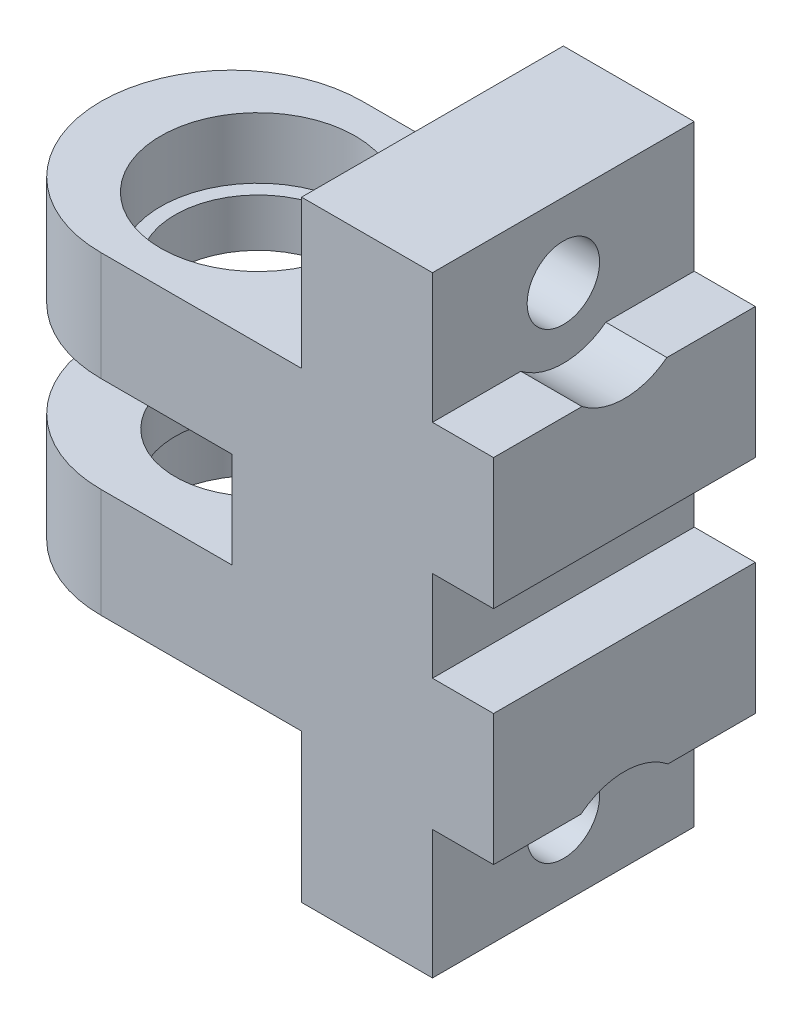
ISO-10303-21;
HEADER;
FILE_DESCRIPTION(('STEP AP214'),'2;1');
FILE_NAME('part.step','',(''),(''),'','','');
FILE_SCHEMA(('AUTOMOTIVE_DESIGN { 1 0 10303 214 1 1 1 1 }'));
ENDSEC;
DATA;
#1=APPLICATION_CONTEXT('core data for automotive mechanical design processes');
#2=APPLICATION_PROTOCOL_DEFINITION('international standard','automotive_design',2000,#1);
#3=PRODUCT_CONTEXT('',#1,'mechanical');
#4=PRODUCT('Part','Part','',(#3));
#5=PRODUCT_RELATED_PRODUCT_CATEGORY('part','',(#4));
#6=PRODUCT_DEFINITION_FORMATION('','',#4);
#7=PRODUCT_DEFINITION_CONTEXT('part definition',#1,'design');
#8=PRODUCT_DEFINITION('design','',#6,#7);
#9=PRODUCT_DEFINITION_SHAPE('','',#8);
#10=(LENGTH_UNIT() NAMED_UNIT(*) SI_UNIT(.MILLI.,.METRE.));
#11=(NAMED_UNIT(*) PLANE_ANGLE_UNIT() SI_UNIT($,.RADIAN.));
#12=(NAMED_UNIT(*) SI_UNIT($,.STERADIAN.) SOLID_ANGLE_UNIT());
#13=UNCERTAINTY_MEASURE_WITH_UNIT(LENGTH_MEASURE(1.E-05),#10,'distance_accuracy_value','');
#14=(GEOMETRIC_REPRESENTATION_CONTEXT(3) GLOBAL_UNCERTAINTY_ASSIGNED_CONTEXT((#13)) GLOBAL_UNIT_ASSIGNED_CONTEXT((#10,
#11,#12)) REPRESENTATION_CONTEXT('',''));
#15=CARTESIAN_POINT('',(0.,0.,0.));
#16=DIRECTION('',(0.,0.,1.));
#17=DIRECTION('',(1.,0.,0.));
#18=AXIS2_PLACEMENT_3D('',#15,#16,#17);
#19=CARTESIAN_POINT('',(0.,36.,0.));
#20=DIRECTION('',(0.,1.,0.));
#21=DIRECTION('',(0.,0.,1.));
#22=AXIS2_PLACEMENT_3D('',#19,#20,#21);
#23=PLANE('',#22);
#24=CARTESIAN_POINT('',(-3.5,36.,0.));
#25=DIRECTION('',(0.,1.,0.));
#26=DIRECTION('',(0.,0.,1.));
#27=AXIS2_PLACEMENT_3D('',#24,#25,#26);
#28=CIRCLE('',#27,11.15);
#29=CARTESIAN_POINT('',(-3.5,36.,11.15));
#30=VERTEX_POINT('',#29);
#31=EDGE_CURVE('E371',#30,#30,#28,.T.);
#32=ORIENTED_EDGE('',*,*,#31,.F.);
#33=EDGE_LOOP('',(#32));
#34=FACE_BOUND('',#33,.T.);
#35=DIRECTION('',(1.,0.,0.));
#36=VECTOR('',#35,1.);
#37=CARTESIAN_POINT('',(21.5,36.,15.));
#38=LINE('',#37,#36);
#39=CARTESIAN_POINT('',(-6.5,36.,15.));
#40=VERTEX_POINT('',#39);
#41=CARTESIAN_POINT('',(16.5,36.,15.));
#42=VERTEX_POINT('',#41);
#43=EDGE_CURVE('E401',#40,#42,#38,.T.);
#44=ORIENTED_EDGE('',*,*,#43,.T.);
#45=DIRECTION('',(0.,0.,1.));
#46=VECTOR('',#45,1.);
#47=CARTESIAN_POINT('',(16.5,36.,-15.));
#48=LINE('',#47,#46);
#49=CARTESIAN_POINT('',(16.5,36.,-15.));
#50=VERTEX_POINT('',#49);
#51=EDGE_CURVE('E238',#50,#42,#48,.T.);
#52=ORIENTED_EDGE('',*,*,#51,.F.);
#53=DIRECTION('',(-1.,0.,0.));
#54=VECTOR('',#53,1.);
#55=CARTESIAN_POINT('',(21.5,36.,-15.));
#56=LINE('',#55,#54);
#57=CARTESIAN_POINT('',(-6.5,36.,-15.));
#58=VERTEX_POINT('',#57);
#59=EDGE_CURVE('E403',#50,#58,#56,.T.);
#60=ORIENTED_EDGE('',*,*,#59,.T.);
#61=CARTESIAN_POINT('',(-6.5,36.,0.));
#62=DIRECTION('',(0.,1.,0.));
#63=DIRECTION('',(0.,0.,1.));
#64=AXIS2_PLACEMENT_3D('',#61,#62,#63);
#65=CIRCLE('',#64,15.);
#66=CARTESIAN_POINT('',(-21.5,36.,0.));
#67=VERTEX_POINT('',#66);
#68=EDGE_CURVE('E45',#58,#67,#65,.T.);
#69=ORIENTED_EDGE('',*,*,#68,.T.);
#70=CARTESIAN_POINT('',(-6.5,36.,0.));
#71=DIRECTION('',(0.,1.,0.));
#72=DIRECTION('',(0.,0.,1.));
#73=AXIS2_PLACEMENT_3D('',#70,#71,#72);
#74=CIRCLE('',#73,15.);
#75=EDGE_CURVE('E11',#67,#40,#74,.T.);
#76=ORIENTED_EDGE('',*,*,#75,.T.);
#77=EDGE_LOOP('',(#44,#52,#60,#69,#76));
#78=FACE_BOUND('',#77,.T.);
#79=ADVANCED_FACE('F36',(#34,#78),#23,.T.);
#80=CARTESIAN_POINT('',(38.5,38.15,15.));
#81=DIRECTION('',(0.,-1.,0.));
#82=DIRECTION('',(0.,0.,-1.));
#83=AXIS2_PLACEMENT_3D('',#80,#81,#82);
#84=PLANE('',#83);
#85=DIRECTION('',(-1.,0.,0.));
#86=VECTOR('',#85,1.);
#87=CARTESIAN_POINT('',(38.5,38.15,4.86595314404075));
#88=LINE('',#87,#86);
#89=CARTESIAN_POINT('',(31.5,38.15,4.86595314404075));
#90=VERTEX_POINT('',#89);
#91=CARTESIAN_POINT('',(38.5,38.15,4.86595314404075));
#92=VERTEX_POINT('',#91);
#93=EDGE_CURVE('E53',#90,#92,#88,.F.);
#94=ORIENTED_EDGE('',*,*,#93,.F.);
#95=DIRECTION('',(0.,0.,1.));
#96=VECTOR('',#95,1.);
#97=CARTESIAN_POINT('',(31.5,38.15,15.));
#98=LINE('',#97,#96);
#99=CARTESIAN_POINT('',(31.5,38.15,15.));
#100=VERTEX_POINT('',#99);
#101=EDGE_CURVE('E311',#90,#100,#98,.T.);
#102=ORIENTED_EDGE('',*,*,#101,.T.);
#103=DIRECTION('',(-1.,0.,0.));
#104=VECTOR('',#103,1.);
#105=CARTESIAN_POINT('',(38.5,38.15,15.));
#106=LINE('',#105,#104);
#107=CARTESIAN_POINT('',(38.5,38.15,15.));
#108=VERTEX_POINT('',#107);
#109=EDGE_CURVE('E335',#108,#100,#106,.T.);
#110=ORIENTED_EDGE('',*,*,#109,.F.);
#111=DIRECTION('',(0.,0.,1.));
#112=VECTOR('',#111,1.);
#113=CARTESIAN_POINT('',(38.5,38.15,15.));
#114=LINE('',#113,#112);
#115=EDGE_CURVE('E315',#92,#108,#114,.T.);
#116=ORIENTED_EDGE('',*,*,#115,.F.);
#117=EDGE_LOOP('',(#94,#102,#110,#116));
#118=FACE_BOUND('',#117,.T.);
#119=ADVANCED_FACE('F525',(#118),#84,.F.);
#120=DIRECTION('',(-1.,0.,0.));
#121=VECTOR('',#120,1.);
#122=CARTESIAN_POINT('',(38.5,38.15,-4.86595314404075));
#123=LINE('',#122,#121);
#124=CARTESIAN_POINT('',(38.5,38.15,-4.86595314404075));
#125=VERTEX_POINT('',#124);
#126=CARTESIAN_POINT('',(31.5,38.15,-4.86595314404075));
#127=VERTEX_POINT('',#126);
#128=EDGE_CURVE('E262',#125,#127,#123,.T.);
#129=ORIENTED_EDGE('',*,*,#128,.F.);
#130=CARTESIAN_POINT('',(38.5,38.15,-15.));
#131=VERTEX_POINT('',#130);
#132=EDGE_CURVE('E317',#131,#125,#114,.T.);
#133=ORIENTED_EDGE('',*,*,#132,.F.);
#134=DIRECTION('',(-1.,0.,0.));
#135=VECTOR('',#134,1.);
#136=CARTESIAN_POINT('',(38.5,38.15,-15.));
#137=LINE('',#136,#135);
#138=CARTESIAN_POINT('',(31.5,38.15,-15.));
#139=VERTEX_POINT('',#138);
#140=EDGE_CURVE('E337',#131,#139,#137,.T.);
#141=ORIENTED_EDGE('',*,*,#140,.T.);
#142=EDGE_CURVE('E325',#139,#127,#98,.T.);
#143=ORIENTED_EDGE('',*,*,#142,.T.);
#144=EDGE_LOOP('',(#129,#133,#141,#143));
#145=FACE_BOUND('',#144,.T.);
#146=ADVANCED_FACE('F469',(#145),#84,.F.);
#147=CARTESIAN_POINT('',(38.5,-2.25,15.));
#148=DIRECTION('',(0.,1.,0.));
#149=DIRECTION('',(0.,0.,1.));
#150=AXIS2_PLACEMENT_3D('',#147,#148,#149);
#151=PLANE('',#150);
#152=DIRECTION('',(-1.,0.,0.));
#153=VECTOR('',#152,1.);
#154=CARTESIAN_POINT('',(38.5,-2.25,-4.99374608885954));
#155=LINE('',#154,#153);
#156=CARTESIAN_POINT('',(31.5,-2.25,-4.99374608885954));
#157=VERTEX_POINT('',#156);
#158=CARTESIAN_POINT('',(38.5,-2.25,-4.99374608885954));
#159=VERTEX_POINT('',#158);
#160=EDGE_CURVE('E61',#157,#159,#155,.F.);
#161=ORIENTED_EDGE('',*,*,#160,.F.);
#162=DIRECTION('',(0.,0.,-1.));
#163=VECTOR('',#162,1.);
#164=CARTESIAN_POINT('',(31.5,-2.25,15.));
#165=LINE('',#164,#163);
#166=CARTESIAN_POINT('',(31.5,-2.25,-15.));
#167=VERTEX_POINT('',#166);
#168=EDGE_CURVE('E297',#157,#167,#165,.T.);
#169=ORIENTED_EDGE('',*,*,#168,.T.);
#170=DIRECTION('',(-1.,0.,0.));
#171=VECTOR('',#170,1.);
#172=CARTESIAN_POINT('',(38.5,-2.25,-15.));
#173=LINE('',#172,#171);
#174=CARTESIAN_POINT('',(38.5,-2.25,-15.));
#175=VERTEX_POINT('',#174);
#176=EDGE_CURVE('E294',#175,#167,#173,.T.);
#177=ORIENTED_EDGE('',*,*,#176,.F.);
#178=DIRECTION('',(0.,0.,-1.));
#179=VECTOR('',#178,1.);
#180=CARTESIAN_POINT('',(38.5,-2.25,15.));
#181=LINE('',#180,#179);
#182=EDGE_CURVE('E290',#159,#175,#181,.T.);
#183=ORIENTED_EDGE('',*,*,#182,.F.);
#184=EDGE_LOOP('',(#161,#169,#177,#183));
#185=FACE_BOUND('',#184,.T.);
#186=ADVANCED_FACE('F503',(#185),#151,.F.);
#187=DIRECTION('',(-1.,0.,0.));
#188=VECTOR('',#187,1.);
#189=CARTESIAN_POINT('',(38.5,-2.25,4.99374608885954));
#190=LINE('',#189,#188);
#191=CARTESIAN_POINT('',(38.5,-2.25,4.99374608885954));
#192=VERTEX_POINT('',#191);
#193=CARTESIAN_POINT('',(31.5,-2.25,4.99374608885954));
#194=VERTEX_POINT('',#193);
#195=EDGE_CURVE('E270',#192,#194,#190,.T.);
#196=ORIENTED_EDGE('',*,*,#195,.F.);
#197=CARTESIAN_POINT('',(38.5,-2.25,15.));
#198=VERTEX_POINT('',#197);
#199=EDGE_CURVE('E291',#198,#192,#181,.T.);
#200=ORIENTED_EDGE('',*,*,#199,.F.);
#201=DIRECTION('',(-1.,0.,0.));
#202=VECTOR('',#201,1.);
#203=CARTESIAN_POINT('',(38.5,-2.25,15.));
#204=LINE('',#203,#202);
#205=CARTESIAN_POINT('',(31.5,-2.25,15.));
#206=VERTEX_POINT('',#205);
#207=EDGE_CURVE('E302',#198,#206,#204,.T.);
#208=ORIENTED_EDGE('',*,*,#207,.T.);
#209=EDGE_CURVE('E286',#206,#194,#165,.T.);
#210=ORIENTED_EDGE('',*,*,#209,.T.);
#211=EDGE_LOOP('',(#196,#200,#208,#210));
#212=FACE_BOUND('',#211,.T.);
#213=ADVANCED_FACE('F511',(#212),#151,.F.);
#214=CARTESIAN_POINT('',(31.5,0.,0.));
#215=DIRECTION('',(1.,0.,0.));
#216=DIRECTION('',(0.,0.,-1.));
#217=AXIS2_PLACEMENT_3D('',#214,#215,#216);
#218=PLANE('',#217);
#219=DIRECTION('',(0.,-1.,0.));
#220=VECTOR('',#219,1.);
#221=CARTESIAN_POINT('',(31.5,53.,15.));
#222=LINE('',#221,#220);
#223=CARTESIAN_POINT('',(31.5,23.15,15.));
#224=VERTEX_POINT('',#223);
#225=CARTESIAN_POINT('',(31.5,12.75,15.));
#226=VERTEX_POINT('',#225);
#227=EDGE_CURVE('E350',#224,#226,#222,.T.);
#228=ORIENTED_EDGE('',*,*,#227,.T.);
#229=DIRECTION('',(0.,0.,1.));
#230=VECTOR('',#229,1.);
#231=CARTESIAN_POINT('',(31.5,12.75,15.));
#232=LINE('',#231,#230);
#233=CARTESIAN_POINT('',(31.5,12.75,-15.));
#234=VERTEX_POINT('',#233);
#235=EDGE_CURVE('E281',#234,#226,#232,.T.);
#236=ORIENTED_EDGE('',*,*,#235,.F.);
#237=DIRECTION('',(0.,1.,0.));
#238=VECTOR('',#237,1.);
#239=CARTESIAN_POINT('',(31.5,53.,-15.));
#240=LINE('',#239,#238);
#241=CARTESIAN_POINT('',(31.5,23.15,-15.));
#242=VERTEX_POINT('',#241);
#243=EDGE_CURVE('E345',#234,#242,#240,.T.);
#244=ORIENTED_EDGE('',*,*,#243,.T.);
#245=DIRECTION('',(0.,0.,-1.));
#246=VECTOR('',#245,1.);
#247=CARTESIAN_POINT('',(31.5,23.15,15.));
#248=LINE('',#247,#246);
#249=EDGE_CURVE('E316',#224,#242,#248,.T.);
#250=ORIENTED_EDGE('',*,*,#249,.F.);
#251=EDGE_LOOP('',(#228,#236,#244,#250));
#252=FACE_BOUND('',#251,.T.);
#253=ADVANCED_FACE('F481',(#252),#218,.T.);
#254=ORIENTED_EDGE('',*,*,#168,.F.);
#255=CARTESIAN_POINT('',(31.5,-8.5,0.));
#256=DIRECTION('',(1.,0.,0.));
#257=DIRECTION('',(0.,0.,-1.));
#258=AXIS2_PLACEMENT_3D('',#255,#256,#257);
#259=CIRCLE('',#258,8.);
#260=EDGE_CURVE('E267',#157,#194,#259,.T.);
#261=ORIENTED_EDGE('',*,*,#260,.T.);
#262=ORIENTED_EDGE('',*,*,#209,.F.);
#263=CARTESIAN_POINT('',(31.5,-17.,15.));
#264=VERTEX_POINT('',#263);
#265=EDGE_CURVE('E347',#206,#264,#222,.T.);
#266=ORIENTED_EDGE('',*,*,#265,.T.);
#267=DIRECTION('',(0.,0.,-1.));
#268=VECTOR('',#267,1.);
#269=CARTESIAN_POINT('',(31.5,-17.,15.));
#270=LINE('',#269,#268);
#271=CARTESIAN_POINT('',(31.5,-17.,-15.));
#272=VERTEX_POINT('',#271);
#273=EDGE_CURVE('E349',#264,#272,#270,.T.);
#274=ORIENTED_EDGE('',*,*,#273,.T.);
#275=EDGE_CURVE('E341',#272,#167,#240,.T.);
#276=ORIENTED_EDGE('',*,*,#275,.T.);
#277=EDGE_LOOP('',(#254,#261,#262,#266,#274,#276));
#278=FACE_BOUND('',#277,.T.);
#279=CARTESIAN_POINT('',(31.5,-8.5,0.));
#280=DIRECTION('',(1.,0.,0.));
#281=DIRECTION('',(0.,0.,-1.));
#282=AXIS2_PLACEMENT_3D('',#279,#280,#281);
#283=CIRCLE('',#282,4.15);
#284=CARTESIAN_POINT('',(31.5,-8.5,-4.15));
#285=VERTEX_POINT('',#284);
#286=EDGE_CURVE('E278',#285,#285,#283,.T.);
#287=ORIENTED_EDGE('',*,*,#286,.F.);
#288=EDGE_LOOP('',(#287));
#289=FACE_BOUND('',#288,.T.);
#290=ADVANCED_FACE('F489',(#278,#289),#218,.T.);
#291=CARTESIAN_POINT('',(21.5,36.,15.));
#292=DIRECTION('',(0.,0.,-1.));
#293=DIRECTION('',(-1.,0.,0.));
#294=AXIS2_PLACEMENT_3D('',#291,#292,#293);
#295=PLANE('',#294);
#296=DIRECTION('',(-1.,0.,0.));
#297=VECTOR('',#296,1.);
#298=CARTESIAN_POINT('',(8.5,12.5,15.));
#299=LINE('',#298,#297);
#300=CARTESIAN_POINT('',(8.5,12.5,15.));
#301=VERTEX_POINT('',#300);
#302=CARTESIAN_POINT('',(-6.5,12.5,15.));
#303=VERTEX_POINT('',#302);
#304=EDGE_CURVE('E397',#301,#303,#299,.T.);
#305=ORIENTED_EDGE('',*,*,#304,.T.);
#306=DIRECTION('',(0.,-1.,0.));
#307=VECTOR('',#306,1.);
#308=CARTESIAN_POINT('',(-6.5,36.,15.));
#309=LINE('',#308,#307);
#310=CARTESIAN_POINT('',(-6.5,0.,15.));
#311=VERTEX_POINT('',#310);
#312=EDGE_CURVE('E429',#303,#311,#309,.T.);
#313=ORIENTED_EDGE('',*,*,#312,.T.);
#314=DIRECTION('',(1.,0.,0.));
#315=VECTOR('',#314,1.);
#316=CARTESIAN_POINT('',(21.5,0.,15.));
#317=LINE('',#316,#315);
#318=CARTESIAN_POINT('',(16.5,0.,15.));
#319=VERTEX_POINT('',#318);
#320=EDGE_CURVE('E393',#311,#319,#317,.T.);
#321=ORIENTED_EDGE('',*,*,#320,.T.);
#322=DIRECTION('',(0.,1.,0.));
#323=VECTOR('',#322,1.);
#324=CARTESIAN_POINT('',(16.5,0.,15.));
#325=LINE('',#324,#323);
#326=CARTESIAN_POINT('',(16.5,-17.,15.));
#327=VERTEX_POINT('',#326);
#328=EDGE_CURVE('E249',#327,#319,#325,.T.);
#329=ORIENTED_EDGE('',*,*,#328,.F.);
#330=DIRECTION('',(-1.,0.,0.));
#331=VECTOR('',#330,1.);
#332=CARTESIAN_POINT('',(31.5,-17.,15.));
#333=LINE('',#332,#331);
#334=EDGE_CURVE('E225',#264,#327,#333,.T.);
#335=ORIENTED_EDGE('',*,*,#334,.F.);
#336=ORIENTED_EDGE('',*,*,#265,.F.);
#337=ORIENTED_EDGE('',*,*,#207,.F.);
#338=DIRECTION('',(0.,-1.,0.));
#339=VECTOR('',#338,1.);
#340=CARTESIAN_POINT('',(38.5,12.75,15.));
#341=LINE('',#340,#339);
#342=CARTESIAN_POINT('',(38.5,12.75,15.));
#343=VERTEX_POINT('',#342);
#344=EDGE_CURVE('E288',#343,#198,#341,.T.);
#345=ORIENTED_EDGE('',*,*,#344,.F.);
#346=DIRECTION('',(-1.,0.,0.));
#347=VECTOR('',#346,1.);
#348=CARTESIAN_POINT('',(38.5,12.75,15.));
#349=LINE('',#348,#347);
#350=EDGE_CURVE('E305',#343,#226,#349,.T.);
#351=ORIENTED_EDGE('',*,*,#350,.T.);
#352=ORIENTED_EDGE('',*,*,#227,.F.);
#353=DIRECTION('',(-1.,0.,0.));
#354=VECTOR('',#353,1.);
#355=CARTESIAN_POINT('',(38.5,23.15,15.));
#356=LINE('',#355,#354);
#357=CARTESIAN_POINT('',(38.5,23.15,15.));
#358=VERTEX_POINT('',#357);
#359=EDGE_CURVE('E332',#358,#224,#356,.T.);
#360=ORIENTED_EDGE('',*,*,#359,.F.);
#361=DIRECTION('',(0.,-1.,0.));
#362=VECTOR('',#361,1.);
#363=CARTESIAN_POINT('',(38.5,23.15,15.));
#364=LINE('',#363,#362);
#365=EDGE_CURVE('E320',#108,#358,#364,.T.);
#366=ORIENTED_EDGE('',*,*,#365,.F.);
#367=ORIENTED_EDGE('',*,*,#109,.T.);
#368=CARTESIAN_POINT('',(31.5,53.,15.));
#369=VERTEX_POINT('',#368);
#370=EDGE_CURVE('E221',#369,#100,#222,.T.);
#371=ORIENTED_EDGE('',*,*,#370,.F.);
#372=DIRECTION('',(-1.,0.,0.));
#373=VECTOR('',#372,1.);
#374=CARTESIAN_POINT('',(31.5,53.,15.));
#375=LINE('',#374,#373);
#376=CARTESIAN_POINT('',(16.5,53.,15.));
#377=VERTEX_POINT('',#376);
#378=EDGE_CURVE('E211',#369,#377,#375,.T.);
#379=ORIENTED_EDGE('',*,*,#378,.T.);
#380=DIRECTION('',(0.,1.,0.));
#381=VECTOR('',#380,1.);
#382=CARTESIAN_POINT('',(16.5,36.,15.));
#383=LINE('',#382,#381);
#384=EDGE_CURVE('E217',#42,#377,#383,.T.);
#385=ORIENTED_EDGE('',*,*,#384,.F.);
#386=ORIENTED_EDGE('',*,*,#43,.F.);
#387=DIRECTION('',(0.,-1.,0.));
#388=VECTOR('',#387,1.);
#389=CARTESIAN_POINT('',(-6.5,36.,15.));
#390=LINE('',#389,#388);
#391=CARTESIAN_POINT('',(-6.5,23.5,15.));
#392=VERTEX_POINT('',#391);
#393=EDGE_CURVE('E426',#40,#392,#390,.T.);
#394=ORIENTED_EDGE('',*,*,#393,.T.);
#395=DIRECTION('',(-1.,0.,0.));
#396=VECTOR('',#395,1.);
#397=CARTESIAN_POINT('',(8.5,23.5,15.));
#398=LINE('',#397,#396);
#399=CARTESIAN_POINT('',(8.5,23.5,15.));
#400=VERTEX_POINT('',#399);
#401=EDGE_CURVE('E394',#400,#392,#398,.T.);
#402=ORIENTED_EDGE('',*,*,#401,.F.);
#403=DIRECTION('',(0.,1.,0.));
#404=VECTOR('',#403,1.);
#405=CARTESIAN_POINT('',(8.5,12.5,15.));
#406=LINE('',#405,#404);
#407=EDGE_CURVE('E385',#301,#400,#406,.T.);
#408=ORIENTED_EDGE('',*,*,#407,.F.);
#409=EDGE_LOOP('',(#305,#313,#321,#329,#335,#336,#337,#345,#351,#352,#360,#366,#367,#371,#379,
#385,#386,#394,#402,#408));
#410=FACE_BOUND('',#409,.T.);
#411=ADVANCED_FACE('F214',(#410),#295,.F.);
#412=CARTESIAN_POINT('',(21.5,36.,-15.));
#413=DIRECTION('',(0.,0.,1.));
#414=DIRECTION('',(1.,0.,0.));
#415=AXIS2_PLACEMENT_3D('',#412,#413,#414);
#416=PLANE('',#415);
#417=ORIENTED_EDGE('',*,*,#59,.F.);
#418=DIRECTION('',(0.,-1.,0.));
#419=VECTOR('',#418,1.);
#420=CARTESIAN_POINT('',(16.5,36.,-15.));
#421=LINE('',#420,#419);
#422=CARTESIAN_POINT('',(16.5,53.,-15.));
#423=VERTEX_POINT('',#422);
#424=EDGE_CURVE('E233',#423,#50,#421,.T.);
#425=ORIENTED_EDGE('',*,*,#424,.F.);
#426=DIRECTION('',(-1.,0.,0.));
#427=VECTOR('',#426,1.);
#428=CARTESIAN_POINT('',(31.5,53.,-15.));
#429=LINE('',#428,#427);
#430=CARTESIAN_POINT('',(31.5,53.,-15.));
#431=VERTEX_POINT('',#430);
#432=EDGE_CURVE('E224',#431,#423,#429,.T.);
#433=ORIENTED_EDGE('',*,*,#432,.F.);
#434=EDGE_CURVE('E340',#139,#431,#240,.T.);
#435=ORIENTED_EDGE('',*,*,#434,.F.);
#436=ORIENTED_EDGE('',*,*,#140,.F.);
#437=DIRECTION('',(0.,1.,0.));
#438=VECTOR('',#437,1.);
#439=CARTESIAN_POINT('',(38.5,23.15,-15.));
#440=LINE('',#439,#438);
#441=CARTESIAN_POINT('',(38.5,23.15,-15.));
#442=VERTEX_POINT('',#441);
#443=EDGE_CURVE('E312',#442,#131,#440,.T.);
#444=ORIENTED_EDGE('',*,*,#443,.F.);
#445=DIRECTION('',(-1.,0.,0.));
#446=VECTOR('',#445,1.);
#447=CARTESIAN_POINT('',(38.5,23.15,-15.));
#448=LINE('',#447,#446);
#449=EDGE_CURVE('E324',#442,#242,#448,.T.);
#450=ORIENTED_EDGE('',*,*,#449,.T.);
#451=ORIENTED_EDGE('',*,*,#243,.F.);
#452=DIRECTION('',(-1.,0.,0.));
#453=VECTOR('',#452,1.);
#454=CARTESIAN_POINT('',(38.5,12.75,-15.));
#455=LINE('',#454,#453);
#456=CARTESIAN_POINT('',(38.5,12.75,-15.));
#457=VERTEX_POINT('',#456);
#458=EDGE_CURVE('E308',#457,#234,#455,.T.);
#459=ORIENTED_EDGE('',*,*,#458,.F.);
#460=DIRECTION('',(0.,1.,0.));
#461=VECTOR('',#460,1.);
#462=CARTESIAN_POINT('',(38.5,12.75,-15.));
#463=LINE('',#462,#461);
#464=EDGE_CURVE('E282',#175,#457,#463,.T.);
#465=ORIENTED_EDGE('',*,*,#464,.F.);
#466=ORIENTED_EDGE('',*,*,#176,.T.);
#467=ORIENTED_EDGE('',*,*,#275,.F.);
#468=DIRECTION('',(-1.,0.,0.));
#469=VECTOR('',#468,1.);
#470=CARTESIAN_POINT('',(31.5,-17.,-15.));
#471=LINE('',#470,#469);
#472=CARTESIAN_POINT('',(16.5,-17.,-15.));
#473=VERTEX_POINT('',#472);
#474=EDGE_CURVE('E352',#272,#473,#471,.T.);
#475=ORIENTED_EDGE('',*,*,#474,.T.);
#476=DIRECTION('',(0.,-1.,0.));
#477=VECTOR('',#476,1.);
#478=CARTESIAN_POINT('',(16.5,0.,-15.));
#479=LINE('',#478,#477);
#480=CARTESIAN_POINT('',(16.5,0.,-15.));
#481=VERTEX_POINT('',#480);
#482=EDGE_CURVE('E253',#481,#473,#479,.T.);
#483=ORIENTED_EDGE('',*,*,#482,.F.);
#484=DIRECTION('',(-1.,0.,0.));
#485=VECTOR('',#484,1.);
#486=CARTESIAN_POINT('',(21.5,0.,-15.));
#487=LINE('',#486,#485);
#488=CARTESIAN_POINT('',(-6.5,0.,-15.));
#489=VERTEX_POINT('',#488);
#490=EDGE_CURVE('E404',#481,#489,#487,.T.);
#491=ORIENTED_EDGE('',*,*,#490,.T.);
#492=DIRECTION('',(0.,-1.,0.));
#493=VECTOR('',#492,1.);
#494=CARTESIAN_POINT('',(-6.5,36.,-15.));
#495=LINE('',#494,#493);
#496=CARTESIAN_POINT('',(-6.5,12.5,-15.));
#497=VERTEX_POINT('',#496);
#498=EDGE_CURVE('E419',#489,#497,#495,.F.);
#499=ORIENTED_EDGE('',*,*,#498,.T.);
#500=DIRECTION('',(-1.,0.,0.));
#501=VECTOR('',#500,1.);
#502=CARTESIAN_POINT('',(8.5,12.5,-15.));
#503=LINE('',#502,#501);
#504=CARTESIAN_POINT('',(8.5,12.5,-15.));
#505=VERTEX_POINT('',#504);
#506=EDGE_CURVE('E389',#505,#497,#503,.T.);
#507=ORIENTED_EDGE('',*,*,#506,.F.);
#508=DIRECTION('',(0.,-1.,0.));
#509=VECTOR('',#508,1.);
#510=CARTESIAN_POINT('',(8.5,12.5,-15.));
#511=LINE('',#510,#509);
#512=CARTESIAN_POINT('',(8.5,23.5,-15.));
#513=VERTEX_POINT('',#512);
#514=EDGE_CURVE('E377',#513,#505,#511,.T.);
#515=ORIENTED_EDGE('',*,*,#514,.F.);
#516=DIRECTION('',(-1.,0.,0.));
#517=VECTOR('',#516,1.);
#518=CARTESIAN_POINT('',(8.5,23.5,-15.));
#519=LINE('',#518,#517);
#520=CARTESIAN_POINT('',(-6.5,23.5,-15.));
#521=VERTEX_POINT('',#520);
#522=EDGE_CURVE('E390',#513,#521,#519,.T.);
#523=ORIENTED_EDGE('',*,*,#522,.T.);
#524=DIRECTION('',(0.,-1.,0.));
#525=VECTOR('',#524,1.);
#526=CARTESIAN_POINT('',(-6.5,36.,-15.));
#527=LINE('',#526,#525);
#528=EDGE_CURVE('E416',#521,#58,#527,.F.);
#529=ORIENTED_EDGE('',*,*,#528,.T.);
#530=EDGE_LOOP('',(#417,#425,#433,#435,#436,#444,#450,#451,#459,#465,#466,#467,#475,#483,#491,
#499,#507,#515,#523,#529));
#531=FACE_BOUND('',#530,.T.);
#532=ADVANCED_FACE('F456',(#531),#416,.F.);
#533=CARTESIAN_POINT('',(0.,0.,0.));
#534=DIRECTION('',(0.,1.,0.));
#535=DIRECTION('',(0.,0.,1.));
#536=AXIS2_PLACEMENT_3D('',#533,#534,#535);
#537=PLANE('',#536);
#538=CARTESIAN_POINT('',(-3.5,0.,0.));
#539=DIRECTION('',(0.,-1.,0.));
#540=DIRECTION('',(0.,0.,-1.));
#541=AXIS2_PLACEMENT_3D('',#538,#539,#540);
#542=CIRCLE('',#541,11.15);
#543=CARTESIAN_POINT('',(-3.5,0.,-11.15));
#544=VERTEX_POINT('',#543);
#545=EDGE_CURVE('E367',#544,#544,#542,.T.);
#546=ORIENTED_EDGE('',*,*,#545,.F.);
#547=EDGE_LOOP('',(#546));
#548=FACE_BOUND('',#547,.T.);
#549=ORIENTED_EDGE('',*,*,#490,.F.);
#550=DIRECTION('',(0.,0.,-1.));
#551=VECTOR('',#550,1.);
#552=CARTESIAN_POINT('',(16.5,0.,-15.));
#553=LINE('',#552,#551);
#554=EDGE_CURVE('E251',#319,#481,#553,.T.);
#555=ORIENTED_EDGE('',*,*,#554,.F.);
#556=ORIENTED_EDGE('',*,*,#320,.F.);
#557=CARTESIAN_POINT('',(-6.5,0.,0.));
#558=DIRECTION('',(0.,1.,0.));
#559=DIRECTION('',(0.,0.,1.));
#560=AXIS2_PLACEMENT_3D('',#557,#558,#559);
#561=CIRCLE('',#560,15.);
#562=CARTESIAN_POINT('',(-21.5,0.,0.));
#563=VERTEX_POINT('',#562);
#564=EDGE_CURVE('E406',#311,#563,#561,.F.);
#565=ORIENTED_EDGE('',*,*,#564,.T.);
#566=CARTESIAN_POINT('',(-6.5,0.,0.));
#567=DIRECTION('',(0.,1.,0.));
#568=DIRECTION('',(0.,0.,1.));
#569=AXIS2_PLACEMENT_3D('',#566,#567,#568);
#570=CIRCLE('',#569,15.);
#571=EDGE_CURVE('E413',#563,#489,#570,.F.);
#572=ORIENTED_EDGE('',*,*,#571,.T.);
#573=EDGE_LOOP('',(#549,#555,#556,#565,#572));
#574=FACE_BOUND('',#573,.T.);
#575=ADVANCED_FACE('F538',(#548,#574),#537,.F.);
#576=CARTESIAN_POINT('',(8.5,23.5,15.));
#577=DIRECTION('',(0.,1.,0.));
#578=DIRECTION('',(0.,0.,1.));
#579=AXIS2_PLACEMENT_3D('',#576,#577,#578);
#580=PLANE('',#579);
#581=CARTESIAN_POINT('',(-3.5,23.5,0.));
#582=DIRECTION('',(0.,1.,0.));
#583=DIRECTION('',(0.,0.,1.));
#584=AXIS2_PLACEMENT_3D('',#581,#582,#583);
#585=CIRCLE('',#584,9.5);
#586=CARTESIAN_POINT('',(-3.5,23.5,9.5));
#587=VERTEX_POINT('',#586);
#588=EDGE_CURVE('E364',#587,#587,#585,.T.);
#589=ORIENTED_EDGE('',*,*,#588,.T.);
#590=EDGE_LOOP('',(#589));
#591=FACE_BOUND('',#590,.T.);
#592=ORIENTED_EDGE('',*,*,#401,.T.);
#593=CARTESIAN_POINT('',(-6.5,23.5,0.));
#594=DIRECTION('',(0.,1.,0.));
#595=DIRECTION('',(0.,0.,1.));
#596=AXIS2_PLACEMENT_3D('',#593,#594,#595);
#597=CIRCLE('',#596,15.);
#598=CARTESIAN_POINT('',(-21.5,23.5,0.));
#599=VERTEX_POINT('',#598);
#600=EDGE_CURVE('E433',#392,#599,#597,.F.);
#601=ORIENTED_EDGE('',*,*,#600,.T.);
#602=CARTESIAN_POINT('',(-6.5,23.5,0.));
#603=DIRECTION('',(0.,1.,0.));
#604=DIRECTION('',(0.,0.,1.));
#605=AXIS2_PLACEMENT_3D('',#602,#603,#604);
#606=CIRCLE('',#605,15.);
#607=EDGE_CURVE('E431',#599,#521,#606,.F.);
#608=ORIENTED_EDGE('',*,*,#607,.T.);
#609=ORIENTED_EDGE('',*,*,#522,.F.);
#610=DIRECTION('',(0.,0.,-1.));
#611=VECTOR('',#610,1.);
#612=CARTESIAN_POINT('',(8.5,23.5,15.));
#613=LINE('',#612,#611);
#614=EDGE_CURVE('E387',#400,#513,#613,.T.);
#615=ORIENTED_EDGE('',*,*,#614,.F.);
#616=EDGE_LOOP('',(#592,#601,#608,#609,#615));
#617=FACE_BOUND('',#616,.T.);
#618=ADVANCED_FACE('F451',(#591,#617),#580,.F.);
#619=CARTESIAN_POINT('',(8.5,12.5,15.));
#620=DIRECTION('',(0.,-1.,0.));
#621=DIRECTION('',(0.,0.,-1.));
#622=AXIS2_PLACEMENT_3D('',#619,#620,#621);
#623=PLANE('',#622);
#624=CARTESIAN_POINT('',(-3.5,12.5,0.));
#625=DIRECTION('',(0.,-1.,0.));
#626=DIRECTION('',(0.,0.,-1.));
#627=AXIS2_PLACEMENT_3D('',#624,#625,#626);
#628=CIRCLE('',#627,9.5);
#629=CARTESIAN_POINT('',(-3.5,12.5,-9.5));
#630=VERTEX_POINT('',#629);
#631=EDGE_CURVE('E361',#630,#630,#628,.T.);
#632=ORIENTED_EDGE('',*,*,#631,.T.);
#633=EDGE_LOOP('',(#632));
#634=FACE_BOUND('',#633,.T.);
#635=ORIENTED_EDGE('',*,*,#506,.T.);
#636=CARTESIAN_POINT('',(-6.5,12.5,0.));
#637=DIRECTION('',(0.,-1.,0.));
#638=DIRECTION('',(0.,0.,-1.));
#639=AXIS2_PLACEMENT_3D('',#636,#637,#638);
#640=CIRCLE('',#639,15.);
#641=CARTESIAN_POINT('',(-21.5,12.5,0.));
#642=VERTEX_POINT('',#641);
#643=EDGE_CURVE('E424',#497,#642,#640,.F.);
#644=ORIENTED_EDGE('',*,*,#643,.T.);
#645=CARTESIAN_POINT('',(-6.5,12.5,0.));
#646=DIRECTION('',(0.,-1.,0.));
#647=DIRECTION('',(0.,0.,-1.));
#648=AXIS2_PLACEMENT_3D('',#645,#646,#647);
#649=CIRCLE('',#648,15.);
#650=EDGE_CURVE('E422',#642,#303,#649,.F.);
#651=ORIENTED_EDGE('',*,*,#650,.T.);
#652=ORIENTED_EDGE('',*,*,#304,.F.);
#653=DIRECTION('',(0.,0.,1.));
#654=VECTOR('',#653,1.);
#655=CARTESIAN_POINT('',(8.5,12.5,15.));
#656=LINE('',#655,#654);
#657=EDGE_CURVE('E382',#505,#301,#656,.T.);
#658=ORIENTED_EDGE('',*,*,#657,.F.);
#659=EDGE_LOOP('',(#635,#644,#651,#652,#658));
#660=FACE_BOUND('',#659,.T.);
#661=ADVANCED_FACE('F536',(#634,#660),#623,.F.);
#662=CARTESIAN_POINT('',(8.5,0.,0.));
#663=DIRECTION('',(-1.,0.,0.));
#664=DIRECTION('',(0.,0.,1.));
#665=AXIS2_PLACEMENT_3D('',#662,#663,#664);
#666=PLANE('',#665);
#667=ORIENTED_EDGE('',*,*,#514,.T.);
#668=ORIENTED_EDGE('',*,*,#657,.T.);
#669=ORIENTED_EDGE('',*,*,#407,.T.);
#670=ORIENTED_EDGE('',*,*,#614,.T.);
#671=EDGE_LOOP('',(#667,#668,#669,#670));
#672=FACE_BOUND('',#671,.T.);
#673=ADVANCED_FACE('F459',(#672),#666,.T.);
#674=CARTESIAN_POINT('',(-3.5,29.,0.));
#675=DIRECTION('',(0.,1.,0.));
#676=DIRECTION('',(0.,0.,1.));
#677=AXIS2_PLACEMENT_3D('',#674,#675,#676);
#678=CYLINDRICAL_SURFACE('',#677,11.15);
#679=CARTESIAN_POINT('',(-3.5,29.,0.));
#680=DIRECTION('',(0.,1.,0.));
#681=DIRECTION('',(0.,0.,1.));
#682=AXIS2_PLACEMENT_3D('',#679,#680,#681);
#683=CIRCLE('',#682,11.15);
#684=CARTESIAN_POINT('',(-3.5,29.,11.15));
#685=VERTEX_POINT('',#684);
#686=EDGE_CURVE('E374',#685,#685,#683,.T.);
#687=ORIENTED_EDGE('',*,*,#686,.F.);
#688=EDGE_LOOP('',(#687));
#689=FACE_BOUND('',#688,.T.);
#690=ORIENTED_EDGE('',*,*,#31,.T.);
#691=EDGE_LOOP('',(#690));
#692=FACE_BOUND('',#691,.T.);
#693=ADVANCED_FACE('F609',(#689,#692),#678,.F.);
#694=CARTESIAN_POINT('',(-3.5,29.,0.));
#695=DIRECTION('',(0.,1.,0.));
#696=DIRECTION('',(0.,0.,1.));
#697=AXIS2_PLACEMENT_3D('',#694,#695,#696);
#698=PLANE('',#697);
#699=CARTESIAN_POINT('',(-3.5,29.,0.));
#700=DIRECTION('',(0.,1.,0.));
#701=DIRECTION('',(0.,0.,1.));
#702=AXIS2_PLACEMENT_3D('',#699,#700,#701);
#703=CIRCLE('',#702,9.5);
#704=CARTESIAN_POINT('',(-3.5,29.,9.5));
#705=VERTEX_POINT('',#704);
#706=EDGE_CURVE('E356',#705,#705,#703,.T.);
#707=ORIENTED_EDGE('',*,*,#706,.F.);
#708=EDGE_LOOP('',(#707));
#709=FACE_BOUND('',#708,.T.);
#710=ORIENTED_EDGE('',*,*,#686,.T.);
#711=EDGE_LOOP('',(#710));
#712=FACE_BOUND('',#711,.T.);
#713=ADVANCED_FACE('F601',(#709,#712),#698,.T.);
#714=CARTESIAN_POINT('',(-3.5,7.,0.));
#715=DIRECTION('',(0.,-1.,0.));
#716=DIRECTION('',(0.,0.,-1.));
#717=AXIS2_PLACEMENT_3D('',#714,#715,#716);
#718=CYLINDRICAL_SURFACE('',#717,11.15);
#719=CARTESIAN_POINT('',(-3.5,7.,0.));
#720=DIRECTION('',(0.,-1.,0.));
#721=DIRECTION('',(0.,0.,-1.));
#722=AXIS2_PLACEMENT_3D('',#719,#720,#721);
#723=CIRCLE('',#722,11.15);
#724=CARTESIAN_POINT('',(-3.5,7.,-11.15));
#725=VERTEX_POINT('',#724);
#726=EDGE_CURVE('E368',#725,#725,#723,.T.);
#727=ORIENTED_EDGE('',*,*,#726,.F.);
#728=EDGE_LOOP('',(#727));
#729=FACE_BOUND('',#728,.T.);
#730=ORIENTED_EDGE('',*,*,#545,.T.);
#731=EDGE_LOOP('',(#730));
#732=FACE_BOUND('',#731,.T.);
#733=ADVANCED_FACE('F592',(#729,#732),#718,.F.);
#734=CARTESIAN_POINT('',(-3.5,7.,0.));
#735=DIRECTION('',(0.,-1.,0.));
#736=DIRECTION('',(0.,0.,-1.));
#737=AXIS2_PLACEMENT_3D('',#734,#735,#736);
#738=PLANE('',#737);
#739=CARTESIAN_POINT('',(-3.5,7.,0.));
#740=DIRECTION('',(0.,-1.,0.));
#741=DIRECTION('',(0.,0.,-1.));
#742=AXIS2_PLACEMENT_3D('',#739,#740,#741);
#743=CIRCLE('',#742,9.5);
#744=CARTESIAN_POINT('',(-3.5,7.,-9.5));
#745=VERTEX_POINT('',#744);
#746=EDGE_CURVE('E359',#745,#745,#743,.T.);
#747=ORIENTED_EDGE('',*,*,#746,.F.);
#748=EDGE_LOOP('',(#747));
#749=FACE_BOUND('',#748,.T.);
#750=ORIENTED_EDGE('',*,*,#726,.T.);
#751=EDGE_LOOP('',(#750));
#752=FACE_BOUND('',#751,.T.);
#753=ADVANCED_FACE('F585',(#749,#752),#738,.T.);
#754=CARTESIAN_POINT('',(-3.5,0.,0.));
#755=DIRECTION('',(0.,1.,0.));
#756=DIRECTION('',(0.,0.,1.));
#757=AXIS2_PLACEMENT_3D('',#754,#755,#756);
#758=CYLINDRICAL_SURFACE('',#757,9.5);
#759=ORIENTED_EDGE('',*,*,#746,.T.);
#760=EDGE_LOOP('',(#759));
#761=FACE_BOUND('',#760,.T.);
#762=ORIENTED_EDGE('',*,*,#631,.F.);
#763=EDGE_LOOP('',(#762));
#764=FACE_BOUND('',#763,.T.);
#765=ADVANCED_FACE('F576',(#761,#764),#758,.F.);
#766=ORIENTED_EDGE('',*,*,#706,.T.);
#767=EDGE_LOOP('',(#766));
#768=FACE_BOUND('',#767,.T.);
#769=ORIENTED_EDGE('',*,*,#588,.F.);
#770=EDGE_LOOP('',(#769));
#771=FACE_BOUND('',#770,.T.);
#772=ADVANCED_FACE('F551',(#768,#771),#758,.F.);
#773=CARTESIAN_POINT('',(-6.5,36.,0.));
#774=DIRECTION('',(0.,-1.,0.));
#775=DIRECTION('',(0.,0.,-1.));
#776=AXIS2_PLACEMENT_3D('',#773,#774,#775);
#777=CYLINDRICAL_SURFACE('',#776,15.);
#778=ORIENTED_EDGE('',*,*,#312,.F.);
#779=ORIENTED_EDGE('',*,*,#650,.F.);
#780=DIRECTION('',(0.,-1.,0.));
#781=VECTOR('',#780,1.);
#782=CARTESIAN_POINT('',(-21.5,36.,0.));
#783=LINE('',#782,#781);
#784=EDGE_CURVE('E360',#563,#642,#783,.F.);
#785=ORIENTED_EDGE('',*,*,#784,.F.);
#786=ORIENTED_EDGE('',*,*,#564,.F.);
#787=EDGE_LOOP('',(#778,#779,#785,#786));
#788=FACE_BOUND('',#787,.T.);
#789=ADVANCED_FACE('F549',(#788),#777,.T.);
#790=CARTESIAN_POINT('',(-6.5,36.,0.));
#791=DIRECTION('',(0.,-1.,0.));
#792=DIRECTION('',(0.,0.,-1.));
#793=AXIS2_PLACEMENT_3D('',#790,#791,#792);
#794=CYLINDRICAL_SURFACE('',#793,15.);
#795=ORIENTED_EDGE('',*,*,#643,.F.);
#796=ORIENTED_EDGE('',*,*,#498,.F.);
#797=ORIENTED_EDGE('',*,*,#571,.F.);
#798=ORIENTED_EDGE('',*,*,#784,.T.);
#799=EDGE_LOOP('',(#795,#796,#797,#798));
#800=FACE_BOUND('',#799,.T.);
#801=ADVANCED_FACE('F546',(#800),#794,.T.);
#802=CARTESIAN_POINT('',(-6.5,36.,0.));
#803=DIRECTION('',(0.,-1.,0.));
#804=DIRECTION('',(0.,0.,-1.));
#805=AXIS2_PLACEMENT_3D('',#802,#803,#804);
#806=CYLINDRICAL_SURFACE('',#805,15.);
#807=DIRECTION('',(0.,-1.,0.));
#808=VECTOR('',#807,1.);
#809=CARTESIAN_POINT('',(-21.5,36.,0.));
#810=LINE('',#809,#808);
#811=EDGE_CURVE('E40',#67,#599,#810,.T.);
#812=ORIENTED_EDGE('',*,*,#811,.F.);
#813=ORIENTED_EDGE('',*,*,#68,.F.);
#814=ORIENTED_EDGE('',*,*,#528,.F.);
#815=ORIENTED_EDGE('',*,*,#607,.F.);
#816=EDGE_LOOP('',(#812,#813,#814,#815));
#817=FACE_BOUND('',#816,.T.);
#818=ADVANCED_FACE('F38',(#817),#806,.T.);
#819=CARTESIAN_POINT('',(-6.5,36.,0.));
#820=DIRECTION('',(0.,-1.,0.));
#821=DIRECTION('',(0.,0.,-1.));
#822=AXIS2_PLACEMENT_3D('',#819,#820,#821);
#823=CYLINDRICAL_SURFACE('',#822,15.);
#824=ORIENTED_EDGE('',*,*,#75,.F.);
#825=ORIENTED_EDGE('',*,*,#811,.T.);
#826=ORIENTED_EDGE('',*,*,#600,.F.);
#827=ORIENTED_EDGE('',*,*,#393,.F.);
#828=EDGE_LOOP('',(#824,#825,#826,#827));
#829=FACE_BOUND('',#828,.T.);
#830=ADVANCED_FACE('F443',(#829),#823,.T.);
#831=CARTESIAN_POINT('',(31.5,53.,15.));
#832=DIRECTION('',(0.,-1.,0.));
#833=DIRECTION('',(0.,0.,-1.));
#834=AXIS2_PLACEMENT_3D('',#831,#832,#833);
#835=PLANE('',#834);
#836=ORIENTED_EDGE('',*,*,#432,.T.);
#837=DIRECTION('',(0.,0.,-1.));
#838=VECTOR('',#837,1.);
#839=CARTESIAN_POINT('',(16.5,53.,-15.));
#840=LINE('',#839,#838);
#841=EDGE_CURVE('E228',#377,#423,#840,.T.);
#842=ORIENTED_EDGE('',*,*,#841,.F.);
#843=ORIENTED_EDGE('',*,*,#378,.F.);
#844=DIRECTION('',(0.,0.,1.));
#845=VECTOR('',#844,1.);
#846=CARTESIAN_POINT('',(31.5,53.,15.));
#847=LINE('',#846,#845);
#848=EDGE_CURVE('E344',#431,#369,#847,.T.);
#849=ORIENTED_EDGE('',*,*,#848,.F.);
#850=EDGE_LOOP('',(#836,#842,#843,#849));
#851=FACE_BOUND('',#850,.T.);
#852=ADVANCED_FACE('F229',(#851),#835,.F.);
#853=CARTESIAN_POINT('',(31.5,-17.,15.));
#854=DIRECTION('',(0.,1.,0.));
#855=DIRECTION('',(0.,0.,1.));
#856=AXIS2_PLACEMENT_3D('',#853,#854,#855);
#857=PLANE('',#856);
#858=ORIENTED_EDGE('',*,*,#334,.T.);
#859=DIRECTION('',(0.,0.,1.));
#860=VECTOR('',#859,1.);
#861=CARTESIAN_POINT('',(16.5,-17.,-15.));
#862=LINE('',#861,#860);
#863=EDGE_CURVE('E256',#473,#327,#862,.T.);
#864=ORIENTED_EDGE('',*,*,#863,.F.);
#865=ORIENTED_EDGE('',*,*,#474,.F.);
#866=ORIENTED_EDGE('',*,*,#273,.F.);
#867=EDGE_LOOP('',(#858,#864,#865,#866));
#868=FACE_BOUND('',#867,.T.);
#869=ADVANCED_FACE('F497',(#868),#857,.F.);
#870=ORIENTED_EDGE('',*,*,#101,.F.);
#871=CARTESIAN_POINT('',(31.5,44.5,0.));
#872=DIRECTION('',(1.,0.,0.));
#873=DIRECTION('',(0.,0.,-1.));
#874=AXIS2_PLACEMENT_3D('',#871,#872,#873);
#875=CIRCLE('',#874,8.);
#876=EDGE_CURVE('E259',#90,#127,#875,.T.);
#877=ORIENTED_EDGE('',*,*,#876,.T.);
#878=ORIENTED_EDGE('',*,*,#142,.F.);
#879=ORIENTED_EDGE('',*,*,#434,.T.);
#880=ORIENTED_EDGE('',*,*,#848,.T.);
#881=ORIENTED_EDGE('',*,*,#370,.T.);
#882=EDGE_LOOP('',(#870,#877,#878,#879,#880,#881));
#883=FACE_BOUND('',#882,.T.);
#884=CARTESIAN_POINT('',(31.5,44.5,0.));
#885=DIRECTION('',(1.,0.,0.));
#886=DIRECTION('',(0.,0.,-1.));
#887=AXIS2_PLACEMENT_3D('',#884,#885,#886);
#888=CIRCLE('',#887,4.15);
#889=CARTESIAN_POINT('',(31.5,44.5,-4.15));
#890=VERTEX_POINT('',#889);
#891=EDGE_CURVE('E275',#890,#890,#888,.T.);
#892=ORIENTED_EDGE('',*,*,#891,.F.);
#893=EDGE_LOOP('',(#892));
#894=FACE_BOUND('',#893,.T.);
#895=ADVANCED_FACE('F653',(#883,#894),#218,.T.);
#896=CARTESIAN_POINT('',(38.5,23.15,15.));
#897=DIRECTION('',(0.,1.,0.));
#898=DIRECTION('',(0.,0.,1.));
#899=AXIS2_PLACEMENT_3D('',#896,#897,#898);
#900=PLANE('',#899);
#901=ORIENTED_EDGE('',*,*,#249,.T.);
#902=ORIENTED_EDGE('',*,*,#449,.F.);
#903=DIRECTION('',(0.,0.,-1.));
#904=VECTOR('',#903,1.);
#905=CARTESIAN_POINT('',(38.5,23.15,15.));
#906=LINE('',#905,#904);
#907=EDGE_CURVE('E322',#358,#442,#906,.T.);
#908=ORIENTED_EDGE('',*,*,#907,.F.);
#909=ORIENTED_EDGE('',*,*,#359,.T.);
#910=EDGE_LOOP('',(#901,#902,#908,#909));
#911=FACE_BOUND('',#910,.T.);
#912=ADVANCED_FACE('F477',(#911),#900,.F.);
#913=CARTESIAN_POINT('',(38.5,0.,0.));
#914=DIRECTION('',(-1.,0.,0.));
#915=DIRECTION('',(0.,0.,1.));
#916=AXIS2_PLACEMENT_3D('',#913,#914,#915);
#917=PLANE('',#916);
#918=CARTESIAN_POINT('',(38.5,44.5,0.));
#919=DIRECTION('',(1.,0.,0.));
#920=DIRECTION('',(0.,0.,-1.));
#921=AXIS2_PLACEMENT_3D('',#918,#919,#920);
#922=CIRCLE('',#921,8.);
#923=EDGE_CURVE('E260',#92,#125,#922,.T.);
#924=ORIENTED_EDGE('',*,*,#923,.F.);
#925=ORIENTED_EDGE('',*,*,#115,.T.);
#926=ORIENTED_EDGE('',*,*,#365,.T.);
#927=ORIENTED_EDGE('',*,*,#907,.T.);
#928=ORIENTED_EDGE('',*,*,#443,.T.);
#929=ORIENTED_EDGE('',*,*,#132,.T.);
#930=EDGE_LOOP('',(#924,#925,#926,#927,#928,#929));
#931=FACE_BOUND('',#930,.T.);
#932=ADVANCED_FACE('F471',(#931),#917,.F.);
#933=CARTESIAN_POINT('',(38.5,12.75,15.));
#934=DIRECTION('',(0.,-1.,0.));
#935=DIRECTION('',(0.,0.,-1.));
#936=AXIS2_PLACEMENT_3D('',#933,#934,#935);
#937=PLANE('',#936);
#938=ORIENTED_EDGE('',*,*,#235,.T.);
#939=ORIENTED_EDGE('',*,*,#350,.F.);
#940=DIRECTION('',(0.,0.,1.));
#941=VECTOR('',#940,1.);
#942=CARTESIAN_POINT('',(38.5,12.75,15.));
#943=LINE('',#942,#941);
#944=EDGE_CURVE('E285',#457,#343,#943,.T.);
#945=ORIENTED_EDGE('',*,*,#944,.F.);
#946=ORIENTED_EDGE('',*,*,#458,.T.);
#947=EDGE_LOOP('',(#938,#939,#945,#946));
#948=FACE_BOUND('',#947,.T.);
#949=ADVANCED_FACE('F513',(#948),#937,.F.);
#950=CARTESIAN_POINT('',(38.5,0.,0.));
#951=DIRECTION('',(1.,0.,0.));
#952=DIRECTION('',(0.,0.,-1.));
#953=AXIS2_PLACEMENT_3D('',#950,#951,#952);
#954=PLANE('',#953);
#955=ORIENTED_EDGE('',*,*,#199,.T.);
#956=CARTESIAN_POINT('',(38.5,-8.5,0.));
#957=DIRECTION('',(1.,0.,0.));
#958=DIRECTION('',(0.,0.,-1.));
#959=AXIS2_PLACEMENT_3D('',#956,#957,#958);
#960=CIRCLE('',#959,8.);
#961=EDGE_CURVE('E268',#159,#192,#960,.T.);
#962=ORIENTED_EDGE('',*,*,#961,.F.);
#963=ORIENTED_EDGE('',*,*,#182,.T.);
#964=ORIENTED_EDGE('',*,*,#464,.T.);
#965=ORIENTED_EDGE('',*,*,#944,.T.);
#966=ORIENTED_EDGE('',*,*,#344,.T.);
#967=EDGE_LOOP('',(#955,#962,#963,#964,#965,#966));
#968=FACE_BOUND('',#967,.T.);
#969=ADVANCED_FACE('F506',(#968),#954,.T.);
#970=CARTESIAN_POINT('',(38.5,-8.5,0.));
#971=DIRECTION('',(-1.,0.,0.));
#972=DIRECTION('',(0.,0.,1.));
#973=AXIS2_PLACEMENT_3D('',#970,#971,#972);
#974=CYLINDRICAL_SURFACE('',#973,4.15);
#975=ORIENTED_EDGE('',*,*,#286,.T.);
#976=EDGE_LOOP('',(#975));
#977=FACE_BOUND('',#976,.T.);
#978=CARTESIAN_POINT('',(16.5,-8.5,0.));
#979=DIRECTION('',(-1.,0.,0.));
#980=DIRECTION('',(0.,0.,1.));
#981=AXIS2_PLACEMENT_3D('',#978,#979,#980);
#982=CIRCLE('',#981,4.15);
#983=CARTESIAN_POINT('',(16.5,-8.5,4.15));
#984=VERTEX_POINT('',#983);
#985=EDGE_CURVE('E246',#984,#984,#982,.T.);
#986=ORIENTED_EDGE('',*,*,#985,.T.);
#987=EDGE_LOOP('',(#986));
#988=FACE_BOUND('',#987,.T.);
#989=ADVANCED_FACE('F520',(#977,#988),#974,.F.);
#990=CARTESIAN_POINT('',(38.5,44.5,0.));
#991=DIRECTION('',(-1.,0.,0.));
#992=DIRECTION('',(0.,0.,1.));
#993=AXIS2_PLACEMENT_3D('',#990,#991,#992);
#994=CYLINDRICAL_SURFACE('',#993,4.15);
#995=ORIENTED_EDGE('',*,*,#891,.T.);
#996=EDGE_LOOP('',(#995));
#997=FACE_BOUND('',#996,.T.);
#998=CARTESIAN_POINT('',(16.5,44.5,0.));
#999=DIRECTION('',(-1.,0.,0.));
#1000=DIRECTION('',(0.,0.,1.));
#1001=AXIS2_PLACEMENT_3D('',#998,#999,#1000);
#1002=CIRCLE('',#1001,4.15);
#1003=CARTESIAN_POINT('',(16.5,44.5,4.15));
#1004=VERTEX_POINT('',#1003);
#1005=EDGE_CURVE('E239',#1004,#1004,#1002,.T.);
#1006=ORIENTED_EDGE('',*,*,#1005,.T.);
#1007=EDGE_LOOP('',(#1006));
#1008=FACE_BOUND('',#1007,.T.);
#1009=ADVANCED_FACE('F720',(#997,#1008),#994,.F.);
#1010=CARTESIAN_POINT('',(38.5,-8.5,0.));
#1011=DIRECTION('',(-1.,0.,0.));
#1012=DIRECTION('',(0.,0.,1.));
#1013=AXIS2_PLACEMENT_3D('',#1010,#1011,#1012);
#1014=CYLINDRICAL_SURFACE('',#1013,8.);
#1015=ORIENTED_EDGE('',*,*,#160,.T.);
#1016=ORIENTED_EDGE('',*,*,#961,.T.);
#1017=ORIENTED_EDGE('',*,*,#195,.T.);
#1018=ORIENTED_EDGE('',*,*,#260,.F.);
#1019=EDGE_LOOP('',(#1015,#1016,#1017,#1018));
#1020=FACE_BOUND('',#1019,.T.);
#1021=ADVANCED_FACE('F509',(#1020),#1014,.F.);
#1022=CARTESIAN_POINT('',(38.5,44.5,0.));
#1023=DIRECTION('',(-1.,0.,0.));
#1024=DIRECTION('',(0.,0.,1.));
#1025=AXIS2_PLACEMENT_3D('',#1022,#1023,#1024);
#1026=CYLINDRICAL_SURFACE('',#1025,8.);
#1027=ORIENTED_EDGE('',*,*,#93,.T.);
#1028=ORIENTED_EDGE('',*,*,#923,.T.);
#1029=ORIENTED_EDGE('',*,*,#128,.T.);
#1030=ORIENTED_EDGE('',*,*,#876,.F.);
#1031=EDGE_LOOP('',(#1027,#1028,#1029,#1030));
#1032=FACE_BOUND('',#1031,.T.);
#1033=ADVANCED_FACE('F719',(#1032),#1026,.F.);
#1034=CARTESIAN_POINT('',(16.5,0.,0.));
#1035=DIRECTION('',(-1.,0.,0.));
#1036=DIRECTION('',(0.,0.,1.));
#1037=AXIS2_PLACEMENT_3D('',#1034,#1035,#1036);
#1038=PLANE('',#1037);
#1039=ORIENTED_EDGE('',*,*,#328,.T.);
#1040=ORIENTED_EDGE('',*,*,#554,.T.);
#1041=ORIENTED_EDGE('',*,*,#482,.T.);
#1042=ORIENTED_EDGE('',*,*,#863,.T.);
#1043=EDGE_LOOP('',(#1039,#1040,#1041,#1042));
#1044=FACE_BOUND('',#1043,.T.);
#1045=ORIENTED_EDGE('',*,*,#985,.F.);
#1046=EDGE_LOOP('',(#1045));
#1047=FACE_BOUND('',#1046,.T.);
#1048=ADVANCED_FACE('F729',(#1044,#1047),#1038,.T.);
#1049=CARTESIAN_POINT('',(16.5,0.,0.));
#1050=DIRECTION('',(1.,0.,0.));
#1051=DIRECTION('',(0.,0.,-1.));
#1052=AXIS2_PLACEMENT_3D('',#1049,#1050,#1051);
#1053=PLANE('',#1052);
#1054=ORIENTED_EDGE('',*,*,#384,.T.);
#1055=ORIENTED_EDGE('',*,*,#841,.T.);
#1056=ORIENTED_EDGE('',*,*,#424,.T.);
#1057=ORIENTED_EDGE('',*,*,#51,.T.);
#1058=EDGE_LOOP('',(#1054,#1055,#1056,#1057));
#1059=FACE_BOUND('',#1058,.T.);
#1060=ORIENTED_EDGE('',*,*,#1005,.F.);
#1061=EDGE_LOOP('',(#1060));
#1062=FACE_BOUND('',#1061,.T.);
#1063=ADVANCED_FACE('F235',(#1059,#1062),#1053,.F.);
#1064=CLOSED_SHELL('',(#79,#119,#146,#186,#213,#253,#290,#411,#532,#575,#618,#661,#673,#693,
#713,#733,#753,#765,#772,#789,#801,#818,#830,#852,#869,#895,#912,#932,#949,#969,#989,#1009,
#1021,#1033,#1048,#1063));
#1065=MANIFOLD_SOLID_BREP('B2',#1064);
#1066=ADVANCED_BREP_SHAPE_REPRESENTATION('',(#18,#1065),#14);
#1067=SHAPE_DEFINITION_REPRESENTATION(#9,#1066);
ENDSEC;
END-ISO-10303-21;
